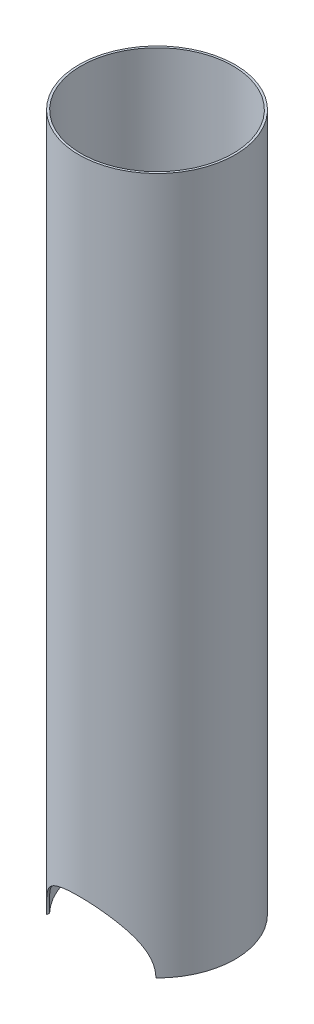
ISO-10303-21;
HEADER;
FILE_DESCRIPTION(('STEP AP214'),'2;1');
FILE_NAME('part.step','',(''),(''),'','','');
FILE_SCHEMA(('AUTOMOTIVE_DESIGN { 1 0 10303 214 1 1 1 1 }'));
ENDSEC;
DATA;
#1=APPLICATION_CONTEXT('core data for automotive mechanical design processes');
#2=APPLICATION_PROTOCOL_DEFINITION('international standard','automotive_design',2000,#1);
#3=PRODUCT_CONTEXT('',#1,'mechanical');
#4=PRODUCT('Part','Part','',(#3));
#5=PRODUCT_RELATED_PRODUCT_CATEGORY('part','',(#4));
#6=PRODUCT_DEFINITION_FORMATION('','',#4);
#7=PRODUCT_DEFINITION_CONTEXT('part definition',#1,'design');
#8=PRODUCT_DEFINITION('design','',#6,#7);
#9=PRODUCT_DEFINITION_SHAPE('','',#8);
#10=(LENGTH_UNIT() NAMED_UNIT(*) SI_UNIT(.MILLI.,.METRE.));
#11=(NAMED_UNIT(*) PLANE_ANGLE_UNIT() SI_UNIT($,.RADIAN.));
#12=(NAMED_UNIT(*) SI_UNIT($,.STERADIAN.) SOLID_ANGLE_UNIT());
#13=UNCERTAINTY_MEASURE_WITH_UNIT(LENGTH_MEASURE(1.E-05),#10,'distance_accuracy_value','');
#14=(GEOMETRIC_REPRESENTATION_CONTEXT(3) GLOBAL_UNCERTAINTY_ASSIGNED_CONTEXT((#13)) GLOBAL_UNIT_ASSIGNED_CONTEXT((#10,
#11,#12)) REPRESENTATION_CONTEXT('',''));
#15=CARTESIAN_POINT('',(0.,0.,0.));
#16=DIRECTION('',(0.,0.,1.));
#17=DIRECTION('',(1.,0.,0.));
#18=AXIS2_PLACEMENT_3D('',#15,#16,#17);
#19=CARTESIAN_POINT('',(0.,-152.4,0.));
#20=DIRECTION('',(0.,1.,0.));
#21=DIRECTION('',(0.,0.,1.));
#22=AXIS2_PLACEMENT_3D('',#19,#20,#21);
#23=CYLINDRICAL_SURFACE('',#22,55.5625);
#24=CARTESIAN_POINT('',(40.,-152.4,-38.5641207114852));
#25=CARTESIAN_POINT('',(40.0000195969433,-151.921048999958,-38.5640755987795));
#26=CARTESIAN_POINT('',(39.9913982517514,-151.442116167436,-38.5730421382334));
#27=CARTESIAN_POINT('',(39.9570221131833,-150.485588362123,-38.608663636908));
#28=CARTESIAN_POINT('',(39.9312696687968,-150.007993214927,-38.6353161710513));
#29=CARTESIAN_POINT('',(39.8628387798256,-149.056132196823,-38.7059139868084));
#30=CARTESIAN_POINT('',(39.820189616346,-148.581862003354,-38.7498293518448));
#31=CARTESIAN_POINT('',(39.718253354937,-147.636990654364,-38.8543052980343));
#32=CARTESIAN_POINT('',(39.6589658572973,-147.166389587269,-38.914866279072));
#33=CARTESIAN_POINT('',(39.4582239464475,-145.772630991729,-39.1187496437198));
#34=CARTESIAN_POINT('',(39.293051999182,-144.856082859314,-39.2851566048631));
#35=CARTESIAN_POINT('',(38.9023118091359,-143.047613411914,-39.672114773465));
#36=CARTESIAN_POINT('',(38.6767195731866,-142.155702035848,-39.8926874874895));
#37=CARTESIAN_POINT('',(38.1705467386969,-140.406993723795,-40.3772526720312));
#38=CARTESIAN_POINT('',(37.8903555682547,-139.549997249572,-40.640935630174));
#39=CARTESIAN_POINT('',(37.27738447975,-137.867328372512,-41.203896103498));
#40=CARTESIAN_POINT('',(36.9446086370942,-137.041653548336,-41.5031708598066));
#41=CARTESIAN_POINT('',(36.2281697557817,-135.420373254081,-42.1300171052182));
#42=CARTESIAN_POINT('',(35.8443476932315,-134.624872165438,-42.4576758587917));
#43=CARTESIAN_POINT('',(35.0289295025326,-133.067465828286,-43.1328855634405));
#44=CARTESIAN_POINT('',(34.5973263964409,-132.305565509614,-43.480439416407));
#45=CARTESIAN_POINT('',(33.6034166555155,-130.677151839921,-44.2545920203218));
#46=CARTESIAN_POINT('',(33.031742593997,-129.817608904855,-44.6838495336064));
#47=CARTESIAN_POINT('',(31.8259770659325,-128.147829065133,-45.5505221083886));
#48=CARTESIAN_POINT('',(31.1918809072528,-127.337595874403,-45.9879377811111));
#49=CARTESIAN_POINT('',(29.8626058258258,-125.767630212695,-46.8620233115159));
#50=CARTESIAN_POINT('',(29.1673976220601,-125.007922259803,-47.2986927083549));
#51=CARTESIAN_POINT('',(27.7175049358017,-123.541674532934,-48.1626789872944));
#52=CARTESIAN_POINT('',(26.9628160410523,-122.835138710861,-48.5899951725672));
#53=CARTESIAN_POINT('',(25.2530381562736,-121.355126084522,-49.5033081922457));
#54=CARTESIAN_POINT('',(24.2864364054725,-120.592771037579,-49.985880504257));
#55=CARTESIAN_POINT('',(22.2746459053841,-119.15290079194,-50.9142247425186));
#56=CARTESIAN_POINT('',(21.2294414869923,-118.475402581223,-51.3599892939452));
#57=CARTESIAN_POINT('',(19.6075002666734,-117.529708986503,-51.9910940594662));
#58=CARTESIAN_POINT('',(19.0581786658584,-117.22639859475,-52.1950934617595));
#59=CARTESIAN_POINT('',(17.9419709592666,-116.644136951044,-52.5892305222189));
#60=CARTESIAN_POINT('',(17.3750874356718,-116.365182140831,-52.779370204566));
#61=CARTESIAN_POINT('',(16.2248169436996,-115.832845256668,-53.1442440218363));
#62=CARTESIAN_POINT('',(15.641435140109,-115.579455290655,-53.3189829089835));
#63=CARTESIAN_POINT('',(14.4591991265247,-115.099347898078,-53.6516553135242));
#64=CARTESIAN_POINT('',(13.8603464429965,-114.872627852238,-53.8095904810795));
#65=CARTESIAN_POINT('',(12.3843351515169,-114.354263865214,-54.1721479962212));
#66=CARTESIAN_POINT('',(11.4995531633013,-114.077345511707,-54.3671484752376));
#67=CARTESIAN_POINT('',(9.70547183668372,-113.584162704031,-54.715904927865));
#68=CARTESIAN_POINT('',(8.79617701535102,-113.36788715761,-54.8696684439558));
#69=CARTESIAN_POINT('',(6.95904769483722,-112.998874383808,-55.132779348077));
#70=CARTESIAN_POINT('',(6.0312262234844,-112.846094049131,-55.2421568688448));
#71=CARTESIAN_POINT('',(4.16279887623049,-112.606052468461,-55.4142820638522));
#72=CARTESIAN_POINT('',(3.22219255759485,-112.518793497365,-55.4770281190506));
#73=CARTESIAN_POINT('',(1.33308073648897,-112.41100248765,-55.5545669985021));
#74=CARTESIAN_POINT('',(0.384562351916492,-112.390618681547,-55.5692532954491));
#75=CARTESIAN_POINT('',(-1.51102272117129,-112.417312417615,-55.5500371632126));
#76=CARTESIAN_POINT('',(-2.45808941519955,-112.464389702956,-55.5161349190095));
#77=CARTESIAN_POINT('',(-4.34377671134144,-112.625293415063,-55.4005015365742));
#78=CARTESIAN_POINT('',(-5.28239537500322,-112.739134783806,-55.3187596917223));
#79=CARTESIAN_POINT('',(-7.14417588128369,-113.031881122932,-55.1092528404868));
#80=CARTESIAN_POINT('',(-8.06733775476927,-113.210785963369,-54.9814879260219));
#81=CARTESIAN_POINT('',(-9.86708827481835,-113.625395429508,-54.6867509511652));
#82=CARTESIAN_POINT('',(-10.7442600439603,-113.859410912848,-54.5209480561532));
#83=CARTESIAN_POINT('',(-12.4733453093906,-114.383794472605,-54.1515343239498));
#84=CARTESIAN_POINT('',(-13.3252594419262,-114.674161128125,-53.9479244400676));
#85=CARTESIAN_POINT('',(-14.9999011114244,-115.308158610052,-53.5064887063603));
#86=CARTESIAN_POINT('',(-15.8226265665667,-115.651793226333,-53.2686604220721));
#87=CARTESIAN_POINT('',(-17.4356637528058,-116.38911026299,-52.7627111150883));
#88=CARTESIAN_POINT('',(-18.2259735579142,-116.782795651471,-52.4945882959746));
#89=CARTESIAN_POINT('',(-19.8575930797128,-117.663444873728,-51.9008900962598));
#90=CARTESIAN_POINT('',(-20.694813761945,-118.155912609023,-51.5722412351485));
#91=CARTESIAN_POINT('',(-22.3236521885782,-119.194761321015,-50.8883717451012));
#92=CARTESIAN_POINT('',(-23.1152670569543,-119.741145691957,-50.5331494436126));
#93=CARTESIAN_POINT('',(-24.6517079830203,-120.884746630589,-49.8016985453226));
#94=CARTESIAN_POINT('',(-25.3964952004563,-121.482004452175,-49.4254529872075));
#95=CARTESIAN_POINT('',(-26.8372497458518,-122.723970356426,-48.6581925093746));
#96=CARTESIAN_POINT('',(-27.5332147584654,-123.368680686513,-48.267176890552));
#97=CARTESIAN_POINT('',(-29.0004392160358,-124.827634310802,-47.4027378602547));
#98=CARTESIAN_POINT('',(-29.7615381842985,-125.651072697631,-46.9275443043487));
#99=CARTESIAN_POINT('',(-31.2118308097417,-127.358500835303,-45.9757059005329));
#100=CARTESIAN_POINT('',(-31.9010097287898,-128.242502935854,-45.4990607756775));
#101=CARTESIAN_POINT('',(-33.2054823819149,-130.069383686417,-44.5559796723513));
#102=CARTESIAN_POINT('',(-33.820740260235,-131.012290574139,-44.0895487373014));
#103=CARTESIAN_POINT('',(-34.9738512398832,-132.955073206931,-43.1805481210434));
#104=CARTESIAN_POINT('',(-35.5117265213811,-133.954932512571,-42.7379716252746));
#105=CARTESIAN_POINT('',(-36.3958488114761,-135.782773036153,-41.9856195315158));
#106=CARTESIAN_POINT('',(-36.7581621691369,-136.599828444807,-41.6681286805753));
#107=CARTESIAN_POINT('',(-37.4307005882734,-138.266701279148,-41.0650464537564));
#108=CARTESIAN_POINT('',(-37.7409258296604,-139.116518591664,-40.7794549676994));
#109=CARTESIAN_POINT('',(-38.3049735126117,-140.843569870609,-40.2500879121526));
#110=CARTESIAN_POINT('',(-38.5590062696754,-141.720687091161,-40.0061572253765));
#111=CARTESIAN_POINT('',(-39.0085357638503,-143.501866100147,-39.5679720361667));
#112=CARTESIAN_POINT('',(-39.2040551842929,-144.405917297499,-39.3736982879535));
#113=CARTESIAN_POINT('',(-39.4722015185812,-145.897033048743,-39.1044510444251));
#114=CARTESIAN_POINT('',(-39.5635342033152,-146.477652837509,-39.0119301155886));
#115=CARTESIAN_POINT('',(-39.7208129659557,-147.645629781838,-38.8517836352518));
#116=CARTESIAN_POINT('',(-39.786765214786,-148.232985263893,-38.7841520324097));
#117=CARTESIAN_POINT('',(-39.8929488843807,-149.415569445651,-38.6749261099863));
#118=CARTESIAN_POINT('',(-39.9330454476521,-150.010823158555,-38.6334683303504));
#119=CARTESIAN_POINT('',(-39.9731926291255,-150.905625143741,-38.5919110220648));
#120=CARTESIAN_POINT('',(-39.9832420908124,-151.204304697352,-38.5814967861623));
#121=CARTESIAN_POINT('',(-39.9966465955195,-151.801982470943,-38.5675993247387));
#122=CARTESIAN_POINT('',(-40.0000014695603,-152.100980698775,-38.564116274169));
#123=CARTESIAN_POINT('',(-40.,-152.4,-38.5641207114852));
#124=B_SPLINE_CURVE_WITH_KNOTS('',3,(#24,#25,#26,#27,#28,#29,#30,#31,#32,#33,#34,#35,#36,#37,
#38,#39,#40,#41,#42,#43,#44,#45,#46,#47,#48,#49,#50,#51,#52,#53,#54,#55,#56,#57,#58,#59,#60,#61,
#62,#63,#64,#65,#66,#67,#68,#69,#70,#71,#72,#73,#74,#75,#76,#77,#78,#79,#80,#81,#82,#83,#84,#85,
#86,#87,#88,#89,#90,#91,#92,#93,#94,#95,#96,#97,#98,#99,#100,#101,#102,#103,#104,#105,#106,#107,
#108,#109,#110,#111,#112,#113,#114,#115,#116,#117,#118,#119,#120,#121,#122,#123),.UNSPECIFIED.,
.F.,.F.,(4,2,2,2,2,2,2,2,2,2,2,2,2,2,2,2,2,2,2,2,2,2,2,2,2,2,2,2,2,2,2,2,2,2,2,2,2,2,2,2,2,2,2,
2,2,2,2,2,2,4),(0.,1.43666082856236,2.87312470502617,4.30711007977334,5.74112990676419,
8.57481837481379,11.4096337860259,14.2249246899018,17.0399975105883,19.864055037584,
22.6885255353262,26.0394472510408,29.3906210408798,32.7434093451389,36.0964465925699,
40.0580011124663,44.0203474553572,45.9991330292687,47.9776290245267,49.9555123620134,
51.9332012874344,54.7721761797301,57.6106314523399,60.4471565194728,63.2837800659605,
66.1266869131817,68.96958293726,71.8131154518674,74.6566422873208,77.422319948356,
80.1879278818566,82.9537326715122,85.7197015551899,88.7929732387547,91.8664385193908,
94.9424202799375,98.0185478174682,101.668300683875,105.318800008983,108.971062938277,
112.622276925014,115.465536205916,118.308785666057,121.141206339583,123.972527567861,
125.756539803565,127.540118005369,129.332925276311,130.22987980713,131.126856977851),.UNSPECIFIED.);
#125=CARTESIAN_POINT('',(40.,-152.4,-38.5641207114852));
#126=VERTEX_POINT('',#125);
#127=CARTESIAN_POINT('',(-40.,-152.4,-38.5641207114853));
#128=VERTEX_POINT('',#127);
#129=EDGE_CURVE('E192',#126,#128,#124,.T.);
#130=ORIENTED_EDGE('',*,*,#129,.F.);
#131=CARTESIAN_POINT('',(0.,-152.4,0.));
#132=DIRECTION('',(0.,1.,0.));
#133=DIRECTION('',(0.,0.,1.));
#134=AXIS2_PLACEMENT_3D('',#131,#132,#133);
#135=CIRCLE('',#134,55.5625);
#136=CARTESIAN_POINT('',(40.,-152.4,38.5641207114851));
#137=VERTEX_POINT('',#136);
#138=EDGE_CURVE('E239',#137,#126,#135,.T.);
#139=ORIENTED_EDGE('',*,*,#138,.F.);
#140=CARTESIAN_POINT('',(-40.,-152.4,38.5641207114852));
#141=CARTESIAN_POINT('',(-40.0000195969433,-151.921048999958,38.5640755987795));
#142=CARTESIAN_POINT('',(-39.9913982517514,-151.442116167436,38.5730421382335));
#143=CARTESIAN_POINT('',(-39.9570221131833,-150.485588362123,38.608663636908));
#144=CARTESIAN_POINT('',(-39.9312696687968,-150.007993214927,38.6353161710513));
#145=CARTESIAN_POINT('',(-39.8628387798256,-149.056132196823,38.7059139868084));
#146=CARTESIAN_POINT('',(-39.820189616346,-148.581862003354,38.7498293518448));
#147=CARTESIAN_POINT('',(-39.718253354937,-147.636990654364,38.8543052980343));
#148=CARTESIAN_POINT('',(-39.6589658572973,-147.166389587269,38.914866279072));
#149=CARTESIAN_POINT('',(-39.4582239464475,-145.772630991729,39.1187496437198));
#150=CARTESIAN_POINT('',(-39.293051999182,-144.856082859314,39.2851566048631));
#151=CARTESIAN_POINT('',(-38.9023118091359,-143.047613411914,39.672114773465));
#152=CARTESIAN_POINT('',(-38.6767195731866,-142.155702035848,39.8926874874896));
#153=CARTESIAN_POINT('',(-38.1705467386969,-140.406993723795,40.3772526720312));
#154=CARTESIAN_POINT('',(-37.8903555682546,-139.549997249571,40.640935630174));
#155=CARTESIAN_POINT('',(-37.2773844797499,-137.867328372512,41.2038961034981));
#156=CARTESIAN_POINT('',(-36.9446086370941,-137.041653548336,41.5031708598067));
#157=CARTESIAN_POINT('',(-36.2281697557817,-135.420373254081,42.1300171052182));
#158=CARTESIAN_POINT('',(-35.8443476932314,-134.624872165438,42.4576758587918));
#159=CARTESIAN_POINT('',(-35.0289295025325,-133.067465828286,43.1328855634405));
#160=CARTESIAN_POINT('',(-34.5973263964408,-132.305565509614,43.4804394164071));
#161=CARTESIAN_POINT('',(-33.6034166555154,-130.677151839921,44.2545920203219));
#162=CARTESIAN_POINT('',(-33.0317425939969,-129.817608904855,44.6838495336065));
#163=CARTESIAN_POINT('',(-31.8259770659324,-128.147829065133,45.5505221083887));
#164=CARTESIAN_POINT('',(-31.1918809072527,-127.337595874403,45.9879377811112));
#165=CARTESIAN_POINT('',(-29.8626058258257,-125.767630212695,46.862023311516));
#166=CARTESIAN_POINT('',(-29.1673976220599,-125.007922259803,47.298692708355));
#167=CARTESIAN_POINT('',(-27.7175049358015,-123.541674532934,48.1626789872945));
#168=CARTESIAN_POINT('',(-26.9628160410521,-122.835138710861,48.5899951725673));
#169=CARTESIAN_POINT('',(-25.2530381562734,-121.355126084522,49.5033081922458));
#170=CARTESIAN_POINT('',(-24.2864364054723,-120.592771037579,49.985880504257));
#171=CARTESIAN_POINT('',(-22.2746459053839,-119.15290079194,50.9142247425187));
#172=CARTESIAN_POINT('',(-21.2294414869921,-118.475402581223,51.3599892939453));
#173=CARTESIAN_POINT('',(-19.6075002666731,-117.529708986503,51.9910940594663));
#174=CARTESIAN_POINT('',(-19.0581786658582,-117.226398594749,52.1950934617596));
#175=CARTESIAN_POINT('',(-17.9419709592664,-116.644136951043,52.589230522219));
#176=CARTESIAN_POINT('',(-17.3750874356715,-116.365182140831,52.779370204566));
#177=CARTESIAN_POINT('',(-16.2248169436994,-115.832845256668,53.1442440218364));
#178=CARTESIAN_POINT('',(-15.6414351401087,-115.579455290655,53.3189829089835));
#179=CARTESIAN_POINT('',(-14.4591991265245,-115.099347898077,53.6516553135242));
#180=CARTESIAN_POINT('',(-13.8603464429963,-114.872627852238,53.8095904810796));
#181=CARTESIAN_POINT('',(-12.3843351515166,-114.354263865214,54.1721479962212));
#182=CARTESIAN_POINT('',(-11.499553163301,-114.077345511707,54.3671484752377));
#183=CARTESIAN_POINT('',(-9.70547183668349,-113.584162704031,54.715904927865));
#184=CARTESIAN_POINT('',(-8.7961770153508,-113.36788715761,54.8696684439558));
#185=CARTESIAN_POINT('',(-6.95904769483701,-112.998874383808,55.1327793480771));
#186=CARTESIAN_POINT('',(-6.0312262234842,-112.846094049131,55.2421568688448));
#187=CARTESIAN_POINT('',(-4.1627988762303,-112.606052468461,55.4142820638522));
#188=CARTESIAN_POINT('',(-3.22219255759466,-112.518793497365,55.4770281190506));
#189=CARTESIAN_POINT('',(-1.33308073648879,-112.41100248765,55.5545669985022));
#190=CARTESIAN_POINT('',(-0.384562351916323,-112.390618681547,55.5692532954491));
#191=CARTESIAN_POINT('',(1.51102272117145,-112.417312417615,55.5500371632126));
#192=CARTESIAN_POINT('',(2.45808941519971,-112.464389702956,55.5161349190095));
#193=CARTESIAN_POINT('',(4.34377671134158,-112.625293415063,55.4005015365742));
#194=CARTESIAN_POINT('',(5.28239537500336,-112.739134783806,55.3187596917223));
#195=CARTESIAN_POINT('',(7.14417588128381,-113.031881122932,55.1092528404868));
#196=CARTESIAN_POINT('',(8.06733775476938,-113.210785963369,54.9814879260219));
#197=CARTESIAN_POINT('',(9.86708827481845,-113.625395429508,54.6867509511652));
#198=CARTESIAN_POINT('',(10.7442600439604,-113.859410912848,54.5209480561532));
#199=CARTESIAN_POINT('',(12.4733453093906,-114.383794472605,54.1515343239497));
#200=CARTESIAN_POINT('',(13.3252594419263,-114.674161128125,53.9479244400675));
#201=CARTESIAN_POINT('',(14.9999011114244,-115.308158610052,53.5064887063603));
#202=CARTESIAN_POINT('',(15.8226265665668,-115.651793226333,53.2686604220721));
#203=CARTESIAN_POINT('',(17.4356637528059,-116.38911026299,52.7627111150883));
#204=CARTESIAN_POINT('',(18.2259735579142,-116.782795651471,52.4945882959746));
#205=CARTESIAN_POINT('',(19.8575930797128,-117.663444873728,51.9008900962597));
#206=CARTESIAN_POINT('',(20.6948137619451,-118.155912609023,51.5722412351484));
#207=CARTESIAN_POINT('',(22.3236521885782,-119.194761321015,50.8883717451012));
#208=CARTESIAN_POINT('',(23.1152670569543,-119.741145691957,50.5331494436126));
#209=CARTESIAN_POINT('',(24.6517079830204,-120.884746630589,49.8016985453225));
#210=CARTESIAN_POINT('',(25.3964952004564,-121.482004452175,49.4254529872075));
#211=CARTESIAN_POINT('',(26.8372497458518,-122.723970356426,48.6581925093746));
#212=CARTESIAN_POINT('',(27.5332147584654,-123.368680686513,48.2671768905519));
#213=CARTESIAN_POINT('',(29.0004392160358,-124.827634310802,47.4027378602547));
#214=CARTESIAN_POINT('',(29.7615381842985,-125.651072697631,46.9275443043487));
#215=CARTESIAN_POINT('',(31.2118308097417,-127.358500835303,45.9757059005329));
#216=CARTESIAN_POINT('',(31.9010097287898,-128.242502935854,45.4990607756775));
#217=CARTESIAN_POINT('',(33.2054823819149,-130.069383686417,44.5559796723513));
#218=CARTESIAN_POINT('',(33.820740260235,-131.012290574139,44.0895487373014));
#219=CARTESIAN_POINT('',(34.9738512398832,-132.955073206931,43.1805481210434));
#220=CARTESIAN_POINT('',(35.5117265213811,-133.954932512571,42.7379716252746));
#221=CARTESIAN_POINT('',(36.3958488114761,-135.782773036153,41.9856195315158));
#222=CARTESIAN_POINT('',(36.758162169137,-136.599828444808,41.6681286805753));
#223=CARTESIAN_POINT('',(37.4307005882735,-138.266701279148,41.0650464537564));
#224=CARTESIAN_POINT('',(37.7409258296604,-139.116518591664,40.7794549676994));
#225=CARTESIAN_POINT('',(38.3049735126118,-140.843569870609,40.2500879121526));
#226=CARTESIAN_POINT('',(38.5590062696754,-141.720687091161,40.0061572253765));
#227=CARTESIAN_POINT('',(39.0085357638504,-143.501866100147,39.5679720361666));
#228=CARTESIAN_POINT('',(39.204055184293,-144.405917297499,39.3736982879534));
#229=CARTESIAN_POINT('',(39.4722015185812,-145.897033048743,39.1044510444251));
#230=CARTESIAN_POINT('',(39.5635342033152,-146.477652837509,39.0119301155886));
#231=CARTESIAN_POINT('',(39.7208129659557,-147.645629781838,38.8517836352518));
#232=CARTESIAN_POINT('',(39.786765214786,-148.232985263893,38.7841520324097));
#233=CARTESIAN_POINT('',(39.8929488843807,-149.415569445652,38.6749261099863));
#234=CARTESIAN_POINT('',(39.9330454476521,-150.010823158555,38.6334683303504));
#235=CARTESIAN_POINT('',(39.9731926291255,-150.905625143741,38.5919110220648));
#236=CARTESIAN_POINT('',(39.9832420908124,-151.204304697352,38.5814967861623));
#237=CARTESIAN_POINT('',(39.9966465955195,-151.801982470943,38.5675993247387));
#238=CARTESIAN_POINT('',(40.0000014695603,-152.100980698776,38.564116274169));
#239=CARTESIAN_POINT('',(40.,-152.4,38.5641207114852));
#240=B_SPLINE_CURVE_WITH_KNOTS('',3,(#140,#141,#142,#143,#144,#145,#146,#147,#148,#149,#150,
#151,#152,#153,#154,#155,#156,#157,#158,#159,#160,#161,#162,#163,#164,#165,#166,#167,#168,#169,
#170,#171,#172,#173,#174,#175,#176,#177,#178,#179,#180,#181,#182,#183,#184,#185,#186,#187,#188,
#189,#190,#191,#192,#193,#194,#195,#196,#197,#198,#199,#200,#201,#202,#203,#204,#205,#206,#207,
#208,#209,#210,#211,#212,#213,#214,#215,#216,#217,#218,#219,#220,#221,#222,#223,#224,#225,#226,
#227,#228,#229,#230,#231,#232,#233,#234,#235,#236,#237,#238,#239),.UNSPECIFIED.,.F.,.F.,(4,2,2,
2,2,2,2,2,2,2,2,2,2,2,2,2,2,2,2,2,2,2,2,2,2,2,2,2,2,2,2,2,2,2,2,2,2,2,2,2,2,2,2,2,2,2,2,2,2,4),
(0.,1.43666082856236,2.87312470502617,4.30711007977334,5.74112990676422,8.57481837481385,
11.4096337860259,14.2249246899019,17.0399975105885,19.8640550375842,22.6885255353263,
26.0394472510409,29.39062104088,32.7434093451392,36.0964465925702,40.0580011124665,
44.0203474553575,45.999133029269,47.9776290245269,49.9555123620136,51.9332012874347,
54.7721761797304,57.6106314523401,60.447156519473,63.2837800659607,66.1266869131819,
68.9695829372602,71.8131154518676,74.6566422873209,77.4223199483561,80.1879278818567,
82.9537326715123,85.7197015551899,88.7929732387548,91.8664385193908,94.9424202799375,
98.0185478174682,101.668300683875,105.318800008983,108.971062938277,112.622276925014,
115.465536205916,118.308785666057,121.141206339584,123.972527567861,125.756539803565,
127.540118005369,129.332925276311,130.22987980713,131.126856977851),.UNSPECIFIED.);
#241=CARTESIAN_POINT('',(-40.,-152.4,38.5641207114852));
#242=VERTEX_POINT('',#241);
#243=EDGE_CURVE('E185',#242,#137,#240,.T.);
#244=ORIENTED_EDGE('',*,*,#243,.F.);
#245=EDGE_CURVE('E237',#128,#242,#135,.T.);
#246=ORIENTED_EDGE('',*,*,#245,.F.);
#247=EDGE_LOOP('',(#130,#139,#244,#246));
#248=FACE_BOUND('',#247,.T.);
#249=CARTESIAN_POINT('',(0.,-110.,0.));
#250=DIRECTION('',(0.,1.,0.));
#251=DIRECTION('',(0.,0.,1.));
#252=AXIS2_PLACEMENT_3D('',#249,#250,#251);
#253=CIRCLE('',#252,55.5625);
#254=CARTESIAN_POINT('',(55.4422348484849,-110.,3.65376535309154));
#255=VERTEX_POINT('',#254);
#256=CARTESIAN_POINT('',(55.4422348484849,-110.,-3.65376535309153));
#257=VERTEX_POINT('',#256);
#258=EDGE_CURVE('E56',#255,#257,#253,.F.);
#259=ORIENTED_EDGE('',*,*,#258,.F.);
#260=DIRECTION('',(0.,1.,0.));
#261=VECTOR('',#260,1.);
#262=CARTESIAN_POINT('',(55.4422348484849,35.,3.65376535309153));
#263=LINE('',#262,#261);
#264=CARTESIAN_POINT('',(55.4422348484849,-120.,3.65376535309154));
#265=VERTEX_POINT('',#264);
#266=EDGE_CURVE('E110',#255,#265,#263,.F.);
#267=ORIENTED_EDGE('',*,*,#266,.T.);
#268=CARTESIAN_POINT('',(0.,-120.,0.));
#269=DIRECTION('',(0.,1.,0.));
#270=DIRECTION('',(0.,0.,1.));
#271=AXIS2_PLACEMENT_3D('',#268,#269,#270);
#272=CIRCLE('',#271,55.5625);
#273=CARTESIAN_POINT('',(55.5625,-120.,0.));
#274=VERTEX_POINT('',#273);
#275=EDGE_CURVE('E38',#274,#265,#272,.F.);
#276=ORIENTED_EDGE('',*,*,#275,.F.);
#277=CARTESIAN_POINT('',(55.4422348484849,-120.,-3.65376535309154));
#278=VERTEX_POINT('',#277);
#279=EDGE_CURVE('E11',#278,#274,#272,.F.);
#280=ORIENTED_EDGE('',*,*,#279,.F.);
#281=DIRECTION('',(0.,1.,0.));
#282=VECTOR('',#281,1.);
#283=CARTESIAN_POINT('',(55.4422348484849,35.,-3.65376535309153));
#284=LINE('',#283,#282);
#285=EDGE_CURVE('E113',#278,#257,#284,.T.);
#286=ORIENTED_EDGE('',*,*,#285,.T.);
#287=EDGE_LOOP('',(#259,#267,#276,#280,#286));
#288=FACE_BOUND('',#287,.T.);
#289=ADVANCED_FACE('F33',(#248,#288),#23,.F.);
#290=CARTESIAN_POINT('',(52.3875,-120.,0.));
#291=DIRECTION('',(0.,1.,0.));
#292=DIRECTION('',(0.,0.,1.));
#293=AXIS2_PLACEMENT_3D('',#290,#291,#292);
#294=CYLINDRICAL_SURFACE('',#293,4.7625);
#295=ORIENTED_EDGE('',*,*,#266,.F.);
#296=CARTESIAN_POINT('',(52.3875,-110.,0.));
#297=DIRECTION('',(0.,1.,0.));
#298=DIRECTION('',(0.,0.,1.));
#299=AXIS2_PLACEMENT_3D('',#296,#297,#298);
#300=CIRCLE('',#299,4.7625);
#301=EDGE_CURVE('E102',#255,#257,#300,.F.);
#302=ORIENTED_EDGE('',*,*,#301,.T.);
#303=ORIENTED_EDGE('',*,*,#285,.F.);
#304=CARTESIAN_POINT('',(52.3875,-120.,0.));
#305=DIRECTION('',(0.,1.,0.));
#306=DIRECTION('',(0.,0.,1.));
#307=AXIS2_PLACEMENT_3D('',#304,#305,#306);
#308=CIRCLE('',#307,4.7625);
#309=EDGE_CURVE('E118',#278,#265,#308,.T.);
#310=ORIENTED_EDGE('',*,*,#309,.T.);
#311=EDGE_LOOP('',(#295,#302,#303,#310));
#312=FACE_BOUND('',#311,.T.);
#313=ADVANCED_FACE('F116',(#312),#294,.T.);
#314=CARTESIAN_POINT('',(0.,357.2,0.));
#315=DIRECTION('',(0.,-1.,0.));
#316=DIRECTION('',(0.,0.,-1.));
#317=AXIS2_PLACEMENT_3D('',#314,#315,#316);
#318=CIRCLE('',#317,55.5625);
#319=CARTESIAN_POINT('',(0.,357.2,-55.5625));
#320=VERTEX_POINT('',#319);
#321=EDGE_CURVE('E150',#320,#320,#318,.F.);
#322=ORIENTED_EDGE('',*,*,#321,.T.);
#323=EDGE_LOOP('',(#322));
#324=FACE_BOUND('',#323,.T.);
#325=CARTESIAN_POINT('',(55.4422348484849,190.,3.65376535309154));
#326=VERTEX_POINT('',#325);
#327=CARTESIAN_POINT('',(55.4422348484849,-108.4125,3.65376535309153));
#328=VERTEX_POINT('',#327);
#329=EDGE_CURVE('E119',#326,#328,#263,.F.);
#330=ORIENTED_EDGE('',*,*,#329,.T.);
#331=CARTESIAN_POINT('',(0.,-108.4125,0.));
#332=DIRECTION('',(0.,1.,0.));
#333=DIRECTION('',(0.,0.,1.));
#334=AXIS2_PLACEMENT_3D('',#331,#332,#333);
#335=CIRCLE('',#334,55.5625);
#336=CARTESIAN_POINT('',(55.4422348484849,-108.4125,-3.65376535309154));
#337=VERTEX_POINT('',#336);
#338=EDGE_CURVE('E133',#328,#337,#335,.F.);
#339=ORIENTED_EDGE('',*,*,#338,.T.);
#340=CARTESIAN_POINT('',(55.4422348484849,190.,-3.65376535309154));
#341=VERTEX_POINT('',#340);
#342=EDGE_CURVE('E122',#337,#341,#284,.T.);
#343=ORIENTED_EDGE('',*,*,#342,.T.);
#344=CARTESIAN_POINT('',(0.,190.,0.));
#345=DIRECTION('',(0.,1.,0.));
#346=DIRECTION('',(0.,0.,1.));
#347=AXIS2_PLACEMENT_3D('',#344,#345,#346);
#348=CIRCLE('',#347,55.5625);
#349=CARTESIAN_POINT('',(55.5625,190.,0.));
#350=VERTEX_POINT('',#349);
#351=EDGE_CURVE('E120',#341,#350,#348,.F.);
#352=ORIENTED_EDGE('',*,*,#351,.T.);
#353=EDGE_CURVE('E124',#350,#326,#348,.F.);
#354=ORIENTED_EDGE('',*,*,#353,.T.);
#355=EDGE_LOOP('',(#330,#339,#343,#352,#354));
#356=FACE_BOUND('',#355,.T.);
#357=ADVANCED_FACE('F130',(#324,#356),#23,.F.);
#358=CARTESIAN_POINT('',(0.,-152.4,0.));
#359=DIRECTION('',(0.,1.,0.));
#360=DIRECTION('',(0.,0.,1.));
#361=AXIS2_PLACEMENT_3D('',#358,#359,#360);
#362=CYLINDRICAL_SURFACE('',#361,57.15);
#363=CARTESIAN_POINT('',(0.,357.2,0.));
#364=DIRECTION('',(0.,-1.,0.));
#365=DIRECTION('',(0.,0.,-1.));
#366=AXIS2_PLACEMENT_3D('',#363,#364,#365);
#367=CIRCLE('',#366,57.15);
#368=CARTESIAN_POINT('',(0.,357.2,-57.15));
#369=VERTEX_POINT('',#368);
#370=EDGE_CURVE('E151',#369,#369,#367,.F.);
#371=ORIENTED_EDGE('',*,*,#370,.F.);
#372=EDGE_LOOP('',(#371));
#373=FACE_BOUND('',#372,.T.);
#374=CARTESIAN_POINT('',(0.,-152.4,0.));
#375=DIRECTION('',(0.,1.,0.));
#376=DIRECTION('',(0.,0.,1.));
#377=AXIS2_PLACEMENT_3D('',#374,#375,#376);
#378=CIRCLE('',#377,57.15);
#379=CARTESIAN_POINT('',(40.,-152.4,40.8181638489533));
#380=VERTEX_POINT('',#379);
#381=CARTESIAN_POINT('',(40.,-152.4,-40.8181638489533));
#382=VERTEX_POINT('',#381);
#383=EDGE_CURVE('E227',#380,#382,#378,.T.);
#384=ORIENTED_EDGE('',*,*,#383,.T.);
#385=CARTESIAN_POINT('',(40.,-152.4,-40.8181638489533));
#386=CARTESIAN_POINT('',(40.0000186340124,-151.916164222238,-40.818122523224));
#387=CARTESIAN_POINT('',(39.9912218474387,-151.432345114019,-40.826765491285));
#388=CARTESIAN_POINT('',(39.9561385077278,-150.466004951917,-40.8611134897357));
#389=CARTESIAN_POINT('',(39.9298540747804,-149.983483747797,-40.8868164517831));
#390=CARTESIAN_POINT('',(39.8599907422634,-149.021633647202,-40.9549251258368));
#391=CARTESIAN_POINT('',(39.8164387631034,-148.542300956949,-40.9973048377278));
#392=CARTESIAN_POINT('',(39.7123163928383,-147.587225967637,-41.0981706977191));
#393=CARTESIAN_POINT('',(39.6517456453839,-147.111483743973,-41.1566571830723));
#394=CARTESIAN_POINT('',(39.4464984455517,-145.7016141696,-41.3537484436422));
#395=CARTESIAN_POINT('',(39.2774836898522,-144.77398033952,-41.5147853476319));
#396=CARTESIAN_POINT('',(38.8773306188897,-142.943133456624,-41.8897409086811));
#397=CARTESIAN_POINT('',(38.6461704106216,-142.039929133645,-42.1036781996985));
#398=CARTESIAN_POINT('',(38.1269439758087,-140.268095844795,-42.5744117288222));
#399=CARTESIAN_POINT('',(37.8392395014147,-139.399287211707,-42.8309339803678));
#400=CARTESIAN_POINT('',(37.209414785767,-137.693322263598,-43.3792132764405));
#401=CARTESIAN_POINT('',(36.8672981311587,-136.85616386681,-43.6709679982714));
#402=CARTESIAN_POINT('',(36.1304616496429,-135.212703026421,-44.2825257846302));
#403=CARTESIAN_POINT('',(35.7355880261421,-134.406500022643,-44.6024098825268));
#404=CARTESIAN_POINT('',(34.8964151985176,-132.828621160684,-45.2619886326816));
#405=CARTESIAN_POINT('',(34.4521090254628,-132.056950192337,-45.6016860749776));
#406=CARTESIAN_POINT('',(33.4347125767752,-130.418078191172,-46.3541708080748));
#407=CARTESIAN_POINT('',(32.8526566376899,-129.5575572017,-46.76940690275));
#408=CARTESIAN_POINT('',(31.6255410571998,-127.886745970526,-47.6077726594025));
#409=CARTESIAN_POINT('',(30.9804768334592,-127.076459389182,-48.0309028936754));
#410=CARTESIAN_POINT('',(29.6288684098384,-125.5075730403,-48.8762550943177));
#411=CARTESIAN_POINT('',(28.9222952587538,-124.748997915263,-49.2984765360767));
#412=CARTESIAN_POINT('',(27.4494961317487,-123.286390437839,-50.1334656930333));
#413=CARTESIAN_POINT('',(26.6832660647051,-122.582361832734,-50.5462327573568));
#414=CARTESIAN_POINT('',(24.9598192945719,-121.119175353307,-51.4219187680908));
#415=CARTESIAN_POINT('',(23.9920848109417,-120.370466587415,-51.8816911642564));
#416=CARTESIAN_POINT('',(21.9804379942056,-118.957958308314,-52.7654165200969));
#417=CARTESIAN_POINT('',(20.9365116380931,-118.294174487625,-53.1893628548961));
#418=CARTESIAN_POINT('',(19.3184519129411,-117.368826486229,-53.7889466757528));
#419=CARTESIAN_POINT('',(18.7707263038664,-117.072245499784,-53.9826532607819));
#420=CARTESIAN_POINT('',(17.6584033229835,-116.50333091763,-54.3566679235854));
#421=CARTESIAN_POINT('',(17.093808371562,-116.230993865542,-54.5369779106618));
#422=CARTESIAN_POINT('',(15.9488115980009,-115.711712294985,-54.8827427324799));
#423=CARTESIAN_POINT('',(15.3684142855725,-115.464760626093,-55.0482017486914));
#424=CARTESIAN_POINT('',(14.1928620818233,-114.997288504122,-55.3629432481536));
#425=CARTESIAN_POINT('',(13.5977085389417,-114.776765646617,-55.5122272028517));
#426=CARTESIAN_POINT('',(12.1161631102906,-114.267820834134,-55.8581803755773));
#427=CARTESIAN_POINT('',(11.222016561548,-113.994975537724,-56.0449599576229));
#428=CARTESIAN_POINT('',(9.40983496130628,-113.511255614239,-56.3775320211925));
#429=CARTESIAN_POINT('',(8.49180416393767,-113.300370032393,-56.5233317479517));
#430=CARTESIAN_POINT('',(6.63795847509548,-112.943342611169,-56.7708882430583));
#431=CARTESIAN_POINT('',(5.7021556559081,-112.797158353782,-56.8726738659198));
#432=CARTESIAN_POINT('',(3.8186433982544,-112.571397083186,-57.0301109348474));
#433=CARTESIAN_POINT('',(2.87093355669135,-112.491822331156,-57.0857608147528));
#434=CARTESIAN_POINT('',(0.968782656406866,-112.400377156578,-57.1497265903034));
#435=CARTESIAN_POINT('',(0.0143320566053297,-112.388639483815,-57.157949676808));
#436=CARTESIAN_POINT('',(-1.89216978919279,-112.433402768753,-57.1266237591986));
#437=CARTESIAN_POINT('',(-2.84422104416436,-112.48990347082,-57.0870749340467));
#438=CARTESIAN_POINT('',(-4.73898262380958,-112.670313616488,-56.9610948128418));
#439=CARTESIAN_POINT('',(-5.68169068261881,-112.794239023071,-56.8746524146213));
#440=CARTESIAN_POINT('',(-7.5508118255262,-113.107719953258,-56.6568008367736));
#441=CARTESIAN_POINT('',(-8.47722489693337,-113.297275527973,-56.5253916221267));
#442=CARTESIAN_POINT('',(-10.2867263829013,-113.7343852094,-56.2239080500049));
#443=CARTESIAN_POINT('',(-11.1703211286287,-113.980510467483,-56.0547888926237));
#444=CARTESIAN_POINT('',(-12.911351599954,-114.530086345761,-55.6795524648625));
#445=CARTESIAN_POINT('',(-13.7687879043568,-114.833535696483,-55.4734360138133));
#446=CARTESIAN_POINT('',(-15.4535704503911,-115.494632230443,-55.0278932641694));
#447=CARTESIAN_POINT('',(-16.2809149540695,-115.852282537916,-54.7884650454937));
#448=CARTESIAN_POINT('',(-17.9022987772333,-116.618553917786,-54.2803109585459));
#449=CARTESIAN_POINT('',(-18.6963361158565,-117.027178015999,-54.0115833511754));
#450=CARTESIAN_POINT('',(-20.3357284002373,-117.940824454372,-53.4174467146831));
#451=CARTESIAN_POINT('',(-21.1768440935955,-118.451518613851,-53.0890610297062));
#452=CARTESIAN_POINT('',(-22.8122071710488,-119.528099997941,-52.4071633997096));
#453=CARTESIAN_POINT('',(-23.6064515655608,-120.093990737052,-52.0536498551278));
#454=CARTESIAN_POINT('',(-25.146883309533,-121.278000152385,-51.3272107505708));
#455=CARTESIAN_POINT('',(-25.8930249361912,-121.89616726525,-50.9542673134139));
#456=CARTESIAN_POINT('',(-27.3349749045541,-123.181307394926,-50.1954733336543));
#457=CARTESIAN_POINT('',(-28.0307808297825,-123.848282751798,-49.8096221726866));
#458=CARTESIAN_POINT('',(-29.4904385267631,-125.35190751968,-48.9619240929266));
#459=CARTESIAN_POINT('',(-30.2442700036111,-126.197593727988,-48.4988048315753));
#460=CARTESIAN_POINT('',(-31.6782350307834,-127.950620811065,-47.5745700982117));
#461=CARTESIAN_POINT('',(-32.3583532706118,-128.857974430936,-47.113455061502));
#462=CARTESIAN_POINT('',(-33.6421969850866,-130.732210639203,-46.2054463783229));
#463=CARTESIAN_POINT('',(-34.2459118565278,-131.699101462512,-45.7585547121902));
#464=CARTESIAN_POINT('',(-35.3731222031574,-133.690365719986,-44.8928661086329));
#465=CARTESIAN_POINT('',(-35.8966432871985,-134.714720660368,-44.4740602264943));
#466=CARTESIAN_POINT('',(-36.7475387496218,-136.575664976274,-43.771808662596));
#467=CARTESIAN_POINT('',(-37.0922877547046,-137.400969755557,-43.4794422349803));
#468=CARTESIAN_POINT('',(-37.7287884767358,-139.08284138411,-42.9282920924943));
#469=CARTESIAN_POINT('',(-38.0205405114894,-139.939408045875,-42.6695081762435));
#470=CARTESIAN_POINT('',(-38.5469081673956,-141.678145746096,-42.194593794113));
#471=CARTESIAN_POINT('',(-38.781714830102,-142.560219742045,-41.978321186527));
#472=CARTESIAN_POINT('',(-39.1920188331758,-144.348529340437,-41.5955195690263));
#473=CARTESIAN_POINT('',(-39.3675416347143,-145.254754389628,-41.4289692080301));
#474=CARTESIAN_POINT('',(-39.5923494430129,-146.680449659213,-41.2138391919886));
#475=CARTESIAN_POINT('',(-39.6631329442857,-147.193710512318,-41.145662293187));
#476=CARTESIAN_POINT('',(-39.7848656076111,-148.224630457511,-41.0279680641771));
#477=CARTESIAN_POINT('',(-39.8358193470793,-148.742288506343,-40.9784464277543));
#478=CARTESIAN_POINT('',(-39.9176784872806,-149.782395936628,-40.898715127835));
#479=CARTESIAN_POINT('',(-39.9485172856489,-150.304855484611,-40.8685696251998));
#480=CARTESIAN_POINT('',(-39.9896946176141,-151.351535421368,-40.8282618772062));
#481=CARTESIAN_POINT('',(-40.0000258079696,-151.875756373575,-40.8181067899066));
#482=CARTESIAN_POINT('',(-40.,-152.4,-40.8181638489533));
#483=B_SPLINE_CURVE_WITH_KNOTS('',3,(#385,#386,#387,#388,#389,#390,#391,#392,#393,#394,#395,
#396,#397,#398,#399,#400,#401,#402,#403,#404,#405,#406,#407,#408,#409,#410,#411,#412,#413,#414,
#415,#416,#417,#418,#419,#420,#421,#422,#423,#424,#425,#426,#427,#428,#429,#430,#431,#432,#433,
#434,#435,#436,#437,#438,#439,#440,#441,#442,#443,#444,#445,#446,#447,#448,#449,#450,#451,#452,
#453,#454,#455,#456,#457,#458,#459,#460,#461,#462,#463,#464,#465,#466,#467,#468,#469,#470,#471,
#472,#473,#474,#475,#476,#477,#478,#479,#480,#481,#482),.UNSPECIFIED.,.F.,.F.,(4,2,2,2,2,2,2,2,
2,2,2,2,2,2,2,2,2,2,2,2,2,2,2,2,2,2,2,2,2,2,2,2,2,2,2,2,2,2,2,2,2,2,2,2,2,2,2,2,4),(0.,
1.45132191123264,2.9024678973027,4.35136036140514,5.80028316556345,8.66549825772682,
11.5317240522249,14.3801768952659,17.2284420568108,20.0851994013184,22.9423599990026,
26.2956603022797,29.6492046592538,33.0043360963996,36.3596978231343,40.2757969969622,
44.1926187497328,46.1488306067446,48.1047631247579,50.0601431874169,52.01534521929,
54.8720744512598,57.7282982955729,60.582646823735,63.4370922439256,66.2971216169428,
69.1571402758135,72.0178363467504,74.8785346455784,77.673668153331,80.4687397685525,
83.2639725577264,86.0593713515201,89.1684376620025,92.277702063621,95.3898795967719,
98.502206437848,102.170023842032,105.838601610593,109.507687944773,113.175600149895,
115.996252416837,118.816887768707,121.627925268381,124.437753946869,126.004884362206,
127.571652813132,129.14358298847,130.716075929682),.UNSPECIFIED.);
#484=CARTESIAN_POINT('',(-40.,-152.4,-40.8181638489533));
#485=VERTEX_POINT('',#484);
#486=EDGE_CURVE('E167',#382,#485,#483,.T.);
#487=ORIENTED_EDGE('',*,*,#486,.T.);
#488=CARTESIAN_POINT('',(-40.,-152.4,40.8181638489533));
#489=VERTEX_POINT('',#488);
#490=EDGE_CURVE('E234',#485,#489,#378,.T.);
#491=ORIENTED_EDGE('',*,*,#490,.T.);
#492=CARTESIAN_POINT('',(-40.,-152.4,40.8181638489533));
#493=CARTESIAN_POINT('',(-40.0000186340124,-151.916164222238,40.818122523224));
#494=CARTESIAN_POINT('',(-39.9912218474387,-151.432345114019,40.826765491285));
#495=CARTESIAN_POINT('',(-39.9561385077278,-150.466004951917,40.8611134897357));
#496=CARTESIAN_POINT('',(-39.9298540747804,-149.983483747797,40.8868164517831));
#497=CARTESIAN_POINT('',(-39.8599907422634,-149.021633647202,40.9549251258368));
#498=CARTESIAN_POINT('',(-39.8164387631034,-148.542300956949,40.9973048377278));
#499=CARTESIAN_POINT('',(-39.7123163928383,-147.587225967637,41.0981706977191));
#500=CARTESIAN_POINT('',(-39.6517456453839,-147.111483743973,41.1566571830723));
#501=CARTESIAN_POINT('',(-39.4464984455517,-145.7016141696,41.3537484436422));
#502=CARTESIAN_POINT('',(-39.2774836898522,-144.77398033952,41.5147853476319));
#503=CARTESIAN_POINT('',(-38.8773306188897,-142.943133456623,41.8897409086811));
#504=CARTESIAN_POINT('',(-38.6461704106216,-142.039929133645,42.1036781996986));
#505=CARTESIAN_POINT('',(-38.1269439758086,-140.268095844795,42.5744117288223));
#506=CARTESIAN_POINT('',(-37.8392395014146,-139.399287211707,42.8309339803678));
#507=CARTESIAN_POINT('',(-37.209414785767,-137.693322263597,43.3792132764405));
#508=CARTESIAN_POINT('',(-36.8672981311587,-136.85616386681,43.6709679982715));
#509=CARTESIAN_POINT('',(-36.1304616496428,-135.212703026421,44.2825257846303));
#510=CARTESIAN_POINT('',(-35.7355880261421,-134.406500022643,44.6024098825268));
#511=CARTESIAN_POINT('',(-34.8964151985176,-132.828621160684,45.2619886326817));
#512=CARTESIAN_POINT('',(-34.4521090254627,-132.056950192337,45.6016860749777));
#513=CARTESIAN_POINT('',(-33.4347125767751,-130.418078191172,46.3541708080749));
#514=CARTESIAN_POINT('',(-32.8526566376898,-129.5575572017,46.7694069027501));
#515=CARTESIAN_POINT('',(-31.6255410571997,-127.886745970525,47.6077726594026));
#516=CARTESIAN_POINT('',(-30.9804768334591,-127.076459389182,48.0309028936755));
#517=CARTESIAN_POINT('',(-29.6288684098382,-125.5075730403,48.8762550943177));
#518=CARTESIAN_POINT('',(-28.9222952587536,-124.748997915263,49.2984765360767));
#519=CARTESIAN_POINT('',(-27.4494961317485,-123.286390437839,50.1334656930334));
#520=CARTESIAN_POINT('',(-26.6832660647049,-122.582361832734,50.5462327573569));
#521=CARTESIAN_POINT('',(-24.9598192945717,-121.119175353307,51.4219187680909));
#522=CARTESIAN_POINT('',(-23.9920848109415,-120.370466587415,51.8816911642565));
#523=CARTESIAN_POINT('',(-21.9804379942054,-118.957958308314,52.765416520097));
#524=CARTESIAN_POINT('',(-20.9365116380928,-118.294174487625,53.1893628548962));
#525=CARTESIAN_POINT('',(-19.3184519129409,-117.368826486229,53.7889466757529));
#526=CARTESIAN_POINT('',(-18.7707263038662,-117.072245499784,53.982653260782));
#527=CARTESIAN_POINT('',(-17.6584033229833,-116.50333091763,54.3566679235855));
#528=CARTESIAN_POINT('',(-17.0938083715618,-116.230993865542,54.5369779106619));
#529=CARTESIAN_POINT('',(-15.9488115980007,-115.711712294985,54.88274273248));
#530=CARTESIAN_POINT('',(-15.3684142855723,-115.464760626093,55.0482017486914));
#531=CARTESIAN_POINT('',(-14.1928620818231,-114.997288504122,55.3629432481536));
#532=CARTESIAN_POINT('',(-13.5977085389415,-114.776765646617,55.5122272028518));
#533=CARTESIAN_POINT('',(-12.1161631102903,-114.267820834134,55.8581803755773));
#534=CARTESIAN_POINT('',(-11.2220165615478,-113.994975537724,56.0449599576229));
#535=CARTESIAN_POINT('',(-9.40983496130607,-113.511255614239,56.3775320211925));
#536=CARTESIAN_POINT('',(-8.49180416393746,-113.300370032393,56.5233317479517));
#537=CARTESIAN_POINT('',(-6.63795847509528,-112.943342611169,56.7708882430583));
#538=CARTESIAN_POINT('',(-5.70215565590789,-112.797158353782,56.8726738659198));
#539=CARTESIAN_POINT('',(-3.81864339825421,-112.571397083186,57.0301109348474));
#540=CARTESIAN_POINT('',(-2.87093355669116,-112.491822331156,57.0857608147528));
#541=CARTESIAN_POINT('',(-0.968782656406692,-112.400377156578,57.1497265903034));
#542=CARTESIAN_POINT('',(-0.0143320566051658,-112.388639483815,57.157949676808));
#543=CARTESIAN_POINT('',(1.89216978919294,-112.433402768753,57.1266237591986));
#544=CARTESIAN_POINT('',(2.8442210441645,-112.48990347082,57.0870749340467));
#545=CARTESIAN_POINT('',(4.73898262380972,-112.670313616488,56.9610948128417));
#546=CARTESIAN_POINT('',(5.68169068261894,-112.794239023071,56.8746524146212));
#547=CARTESIAN_POINT('',(7.55081182552631,-113.107719953258,56.6568008367736));
#548=CARTESIAN_POINT('',(8.47722489693348,-113.297275527973,56.5253916221267));
#549=CARTESIAN_POINT('',(10.2867263829014,-113.7343852094,56.2239080500049));
#550=CARTESIAN_POINT('',(11.1703211286288,-113.980510467483,56.0547888926237));
#551=CARTESIAN_POINT('',(12.9113515999541,-114.530086345761,55.6795524648625));
#552=CARTESIAN_POINT('',(13.7687879043569,-114.833535696483,55.4734360138133));
#553=CARTESIAN_POINT('',(15.4535704503912,-115.494632230443,55.0278932641694));
#554=CARTESIAN_POINT('',(16.2809149540696,-115.852282537916,54.7884650454937));
#555=CARTESIAN_POINT('',(17.9022987772334,-116.618553917786,54.2803109585458));
#556=CARTESIAN_POINT('',(18.6963361158565,-117.027178015999,54.0115833511754));
#557=CARTESIAN_POINT('',(20.3357284002373,-117.940824454372,53.417446714683));
#558=CARTESIAN_POINT('',(21.1768440935955,-118.451518613851,53.0890610297062));
#559=CARTESIAN_POINT('',(22.8122071710489,-119.528099997941,52.4071633997096));
#560=CARTESIAN_POINT('',(23.6064515655608,-120.093990737052,52.0536498551278));
#561=CARTESIAN_POINT('',(25.1468833095331,-121.278000152385,51.3272107505708));
#562=CARTESIAN_POINT('',(25.8930249361913,-121.89616726525,50.9542673134139));
#563=CARTESIAN_POINT('',(27.3349749045541,-123.181307394926,50.1954733336543));
#564=CARTESIAN_POINT('',(28.0307808297825,-123.848282751798,49.8096221726866));
#565=CARTESIAN_POINT('',(29.4904385267631,-125.35190751968,48.9619240929266));
#566=CARTESIAN_POINT('',(30.2442700036111,-126.197593727988,48.4988048315753));
#567=CARTESIAN_POINT('',(31.6782350307834,-127.950620811065,47.5745700982117));
#568=CARTESIAN_POINT('',(32.3583532706118,-128.857974430936,47.113455061502));
#569=CARTESIAN_POINT('',(33.6421969850866,-130.732210639203,46.2054463783229));
#570=CARTESIAN_POINT('',(34.2459118565277,-131.699101462512,45.7585547121903));
#571=CARTESIAN_POINT('',(35.3731222031573,-133.690365719986,44.8928661086329));
#572=CARTESIAN_POINT('',(35.8966432871985,-134.714720660367,44.4740602264943));
#573=CARTESIAN_POINT('',(36.7475387496218,-136.575664976274,43.771808662596));
#574=CARTESIAN_POINT('',(37.0922877547046,-137.400969755557,43.4794422349803));
#575=CARTESIAN_POINT('',(37.7287884767358,-139.08284138411,42.9282920924943));
#576=CARTESIAN_POINT('',(38.0205405114895,-139.939408045875,42.6695081762435));
#577=CARTESIAN_POINT('',(38.5469081673956,-141.678145746096,42.194593794113));
#578=CARTESIAN_POINT('',(38.781714830102,-142.560219742045,41.978321186527));
#579=CARTESIAN_POINT('',(39.1920188331758,-144.348529340437,41.5955195690263));
#580=CARTESIAN_POINT('',(39.3675416347143,-145.254754389628,41.42896920803));
#581=CARTESIAN_POINT('',(39.5923494430129,-146.680449659213,41.2138391919886));
#582=CARTESIAN_POINT('',(39.6631329442857,-147.193710512318,41.145662293187));
#583=CARTESIAN_POINT('',(39.7848656076111,-148.224630457511,41.0279680641771));
#584=CARTESIAN_POINT('',(39.8358193470793,-148.742288506343,40.9784464277543));
#585=CARTESIAN_POINT('',(39.9176784872806,-149.782395936629,40.898715127835));
#586=CARTESIAN_POINT('',(39.9485172856489,-150.304855484611,40.8685696251998));
#587=CARTESIAN_POINT('',(39.9896946176141,-151.351535421368,40.8282618772062));
#588=CARTESIAN_POINT('',(40.0000258079696,-151.875756373575,40.8181067899066));
#589=CARTESIAN_POINT('',(40.,-152.4,40.8181638489533));
#590=B_SPLINE_CURVE_WITH_KNOTS('',3,(#492,#493,#494,#495,#496,#497,#498,#499,#500,#501,#502,
#503,#504,#505,#506,#507,#508,#509,#510,#511,#512,#513,#514,#515,#516,#517,#518,#519,#520,#521,
#522,#523,#524,#525,#526,#527,#528,#529,#530,#531,#532,#533,#534,#535,#536,#537,#538,#539,#540,
#541,#542,#543,#544,#545,#546,#547,#548,#549,#550,#551,#552,#553,#554,#555,#556,#557,#558,#559,
#560,#561,#562,#563,#564,#565,#566,#567,#568,#569,#570,#571,#572,#573,#574,#575,#576,#577,#578,
#579,#580,#581,#582,#583,#584,#585,#586,#587,#588,#589),.UNSPECIFIED.,.F.,.F.,(4,2,2,2,2,2,2,2,
2,2,2,2,2,2,2,2,2,2,2,2,2,2,2,2,2,2,2,2,2,2,2,2,2,2,2,2,2,2,2,2,2,2,2,2,2,2,2,2,4),(0.,
1.45132191123264,2.90246789730273,4.35136036140514,5.80028316556348,8.66549825772688,
11.531724052225,14.380176895266,17.2284420568109,20.0851994013186,22.9423599990028,
26.2956603022799,29.649204659254,33.0043360963999,36.3596978231346,40.2757969969625,
44.1926187497331,46.1488306067448,48.1047631247581,50.0601431874171,52.0153452192902,
54.87207445126,57.7282982955731,60.5826468237352,63.4370922439258,66.2971216169429,
69.1571402758136,72.0178363467505,74.8785346455785,77.6736681533311,80.4687397685526,
83.2639725577264,86.0593713515201,89.1684376620025,92.277702063621,95.3898795967719,
98.502206437848,102.170023842032,105.838601610593,109.507687944773,113.175600149895,
115.996252416837,118.816887768707,121.627925268381,124.437753946869,126.004884362206,
127.571652813132,129.14358298847,130.716075929682),.UNSPECIFIED.);
#591=EDGE_CURVE('E161',#489,#380,#590,.T.);
#592=ORIENTED_EDGE('',*,*,#591,.T.);
#593=EDGE_LOOP('',(#384,#487,#491,#592));
#594=FACE_BOUND('',#593,.T.);
#595=ADVANCED_FACE('F35',(#373,#594),#362,.T.);
#596=CARTESIAN_POINT('',(0.,-152.4,0.));
#597=DIRECTION('',(0.,1.,0.));
#598=DIRECTION('',(0.,0.,1.));
#599=AXIS2_PLACEMENT_3D('',#596,#597,#598);
#600=PLANE('',#599);
#601=DIRECTION('',(0.,0.,-1.));
#602=VECTOR('',#601,1.);
#603=CARTESIAN_POINT('',(40.,-152.4,859.771522638881));
#604=LINE('',#603,#602);
#605=EDGE_CURVE('E154',#126,#382,#604,.T.);
#606=ORIENTED_EDGE('',*,*,#605,.T.);
#607=ORIENTED_EDGE('',*,*,#383,.F.);
#608=EDGE_CURVE('E159',#380,#137,#604,.T.);
#609=ORIENTED_EDGE('',*,*,#608,.T.);
#610=ORIENTED_EDGE('',*,*,#138,.T.);
#611=EDGE_LOOP('',(#606,#607,#609,#610));
#612=FACE_BOUND('',#611,.T.);
#613=ADVANCED_FACE('F216',(#612),#600,.F.);
#614=DIRECTION('',(0.,0.,-1.));
#615=VECTOR('',#614,1.);
#616=CARTESIAN_POINT('',(-40.,-152.4,859.771522638881));
#617=LINE('',#616,#615);
#618=EDGE_CURVE('E158',#489,#242,#617,.T.);
#619=ORIENTED_EDGE('',*,*,#618,.F.);
#620=ORIENTED_EDGE('',*,*,#490,.F.);
#621=EDGE_CURVE('E155',#128,#485,#617,.T.);
#622=ORIENTED_EDGE('',*,*,#621,.F.);
#623=ORIENTED_EDGE('',*,*,#245,.T.);
#624=EDGE_LOOP('',(#619,#620,#622,#623));
#625=FACE_BOUND('',#624,.T.);
#626=ADVANCED_FACE('F221',(#625),#600,.F.);
#627=CARTESIAN_POINT('',(0.,-152.4,859.771522638881));
#628=DIRECTION('',(0.,0.,-1.));
#629=DIRECTION('',(-1.,0.,0.));
#630=AXIS2_PLACEMENT_3D('',#627,#628,#629);
#631=CYLINDRICAL_SURFACE('',#630,40.);
#632=ORIENTED_EDGE('',*,*,#591,.F.);
#633=ORIENTED_EDGE('',*,*,#618,.T.);
#634=ORIENTED_EDGE('',*,*,#243,.T.);
#635=ORIENTED_EDGE('',*,*,#608,.F.);
#636=EDGE_LOOP('',(#632,#633,#634,#635));
#637=FACE_BOUND('',#636,.T.);
#638=ADVANCED_FACE('F178',(#637),#631,.F.);
#639=ORIENTED_EDGE('',*,*,#486,.F.);
#640=ORIENTED_EDGE('',*,*,#605,.F.);
#641=ORIENTED_EDGE('',*,*,#129,.T.);
#642=ORIENTED_EDGE('',*,*,#621,.T.);
#643=EDGE_LOOP('',(#639,#640,#641,#642));
#644=FACE_BOUND('',#643,.T.);
#645=ADVANCED_FACE('F172',(#644),#631,.F.);
#646=CARTESIAN_POINT('',(-57.15,357.2,-57.15));
#647=DIRECTION('',(0.,-1.,0.));
#648=DIRECTION('',(0.,0.,-1.));
#649=AXIS2_PLACEMENT_3D('',#646,#647,#648);
#650=PLANE('',#649);
#651=ORIENTED_EDGE('',*,*,#370,.T.);
#652=EDGE_LOOP('',(#651));
#653=FACE_BOUND('',#652,.T.);
#654=ORIENTED_EDGE('',*,*,#321,.F.);
#655=EDGE_LOOP('',(#654));
#656=FACE_BOUND('',#655,.T.);
#657=ADVANCED_FACE('F177',(#653,#656),#650,.F.);
#658=CARTESIAN_POINT('',(52.3875,-108.4125,0.));
#659=DIRECTION('',(0.,1.,0.));
#660=DIRECTION('',(0.,0.,1.));
#661=AXIS2_PLACEMENT_3D('',#658,#659,#660);
#662=CIRCLE('',#661,4.7625);
#663=EDGE_CURVE('E49',#328,#337,#662,.F.);
#664=ORIENTED_EDGE('',*,*,#663,.F.);
#665=ORIENTED_EDGE('',*,*,#329,.F.);
#666=CARTESIAN_POINT('',(52.3875,190.,0.));
#667=DIRECTION('',(0.,1.,0.));
#668=DIRECTION('',(0.,0.,1.));
#669=AXIS2_PLACEMENT_3D('',#666,#667,#668);
#670=CIRCLE('',#669,4.7625);
#671=EDGE_CURVE('E138',#341,#326,#670,.T.);
#672=ORIENTED_EDGE('',*,*,#671,.F.);
#673=ORIENTED_EDGE('',*,*,#342,.F.);
#674=EDGE_LOOP('',(#664,#665,#672,#673));
#675=FACE_BOUND('',#674,.T.);
#676=ADVANCED_FACE('F141',(#675),#294,.T.);
#677=CARTESIAN_POINT('',(52.3875,-120.,0.));
#678=DIRECTION('',(0.,1.,0.));
#679=DIRECTION('',(0.,0.,1.));
#680=AXIS2_PLACEMENT_3D('',#677,#678,#679);
#681=PLANE('',#680);
#682=ORIENTED_EDGE('',*,*,#309,.F.);
#683=ORIENTED_EDGE('',*,*,#279,.T.);
#684=CARTESIAN_POINT('',(52.3875,-120.,0.));
#685=DIRECTION('',(0.,1.,0.));
#686=DIRECTION('',(0.,0.,1.));
#687=AXIS2_PLACEMENT_3D('',#684,#685,#686);
#688=CIRCLE('',#687,3.17500000000001);
#689=EDGE_CURVE('E142',#274,#274,#688,.T.);
#690=ORIENTED_EDGE('',*,*,#689,.T.);
#691=ORIENTED_EDGE('',*,*,#275,.T.);
#692=EDGE_LOOP('',(#682,#683,#690,#691));
#693=FACE_BOUND('',#692,.T.);
#694=ADVANCED_FACE('F206',(#693),#681,.F.);
#695=CARTESIAN_POINT('',(52.3875,190.,0.));
#696=DIRECTION('',(0.,1.,0.));
#697=DIRECTION('',(0.,0.,1.));
#698=AXIS2_PLACEMENT_3D('',#695,#696,#697);
#699=PLANE('',#698);
#700=ORIENTED_EDGE('',*,*,#351,.F.);
#701=ORIENTED_EDGE('',*,*,#671,.T.);
#702=ORIENTED_EDGE('',*,*,#353,.F.);
#703=CARTESIAN_POINT('',(52.3875,190.,0.));
#704=DIRECTION('',(0.,1.,0.));
#705=DIRECTION('',(0.,0.,1.));
#706=AXIS2_PLACEMENT_3D('',#703,#704,#705);
#707=CIRCLE('',#706,3.17500000000001);
#708=EDGE_CURVE('E140',#350,#350,#707,.T.);
#709=ORIENTED_EDGE('',*,*,#708,.F.);
#710=EDGE_LOOP('',(#700,#701,#702,#709));
#711=FACE_BOUND('',#710,.T.);
#712=ADVANCED_FACE('F137',(#711),#699,.T.);
#713=CARTESIAN_POINT('',(52.3875,-120.,0.));
#714=DIRECTION('',(0.,1.,0.));
#715=DIRECTION('',(0.,0.,1.));
#716=AXIS2_PLACEMENT_3D('',#713,#714,#715);
#717=CYLINDRICAL_SURFACE('',#716,3.17500000000001);
#718=ORIENTED_EDGE('',*,*,#708,.T.);
#719=EDGE_LOOP('',(#718));
#720=FACE_BOUND('',#719,.T.);
#721=ORIENTED_EDGE('',*,*,#689,.F.);
#722=EDGE_LOOP('',(#721));
#723=FACE_BOUND('',#722,.T.);
#724=ADVANCED_FACE('F279',(#720,#723),#717,.F.);
#725=CARTESIAN_POINT('',(0.,-110.,0.));
#726=DIRECTION('',(0.,1.,0.));
#727=DIRECTION('',(0.,0.,1.));
#728=AXIS2_PLACEMENT_3D('',#725,#726,#727);
#729=PLANE('',#728);
#730=ORIENTED_EDGE('',*,*,#301,.F.);
#731=ORIENTED_EDGE('',*,*,#258,.T.);
#732=EDGE_LOOP('',(#730,#731));
#733=FACE_BOUND('',#732,.T.);
#734=ADVANCED_FACE('F103',(#733),#729,.F.);
#735=CARTESIAN_POINT('',(0.,-108.4125,0.));
#736=DIRECTION('',(0.,1.,0.));
#737=DIRECTION('',(0.,0.,1.));
#738=AXIS2_PLACEMENT_3D('',#735,#736,#737);
#739=PLANE('',#738);
#740=ORIENTED_EDGE('',*,*,#338,.F.);
#741=ORIENTED_EDGE('',*,*,#663,.T.);
#742=EDGE_LOOP('',(#740,#741));
#743=FACE_BOUND('',#742,.T.);
#744=ADVANCED_FACE('F319',(#743),#739,.T.);
#745=CLOSED_SHELL('',(#289,#313,#357,#595,#613,#626,#638,#645,#657,#676,#694,#712,#724,#734,#744));
#746=MANIFOLD_SOLID_BREP('B2',#745);
#747=ADVANCED_BREP_SHAPE_REPRESENTATION('',(#18,#746),#14);
#748=SHAPE_DEFINITION_REPRESENTATION(#9,#747);
ENDSEC;
END-ISO-10303-21;
